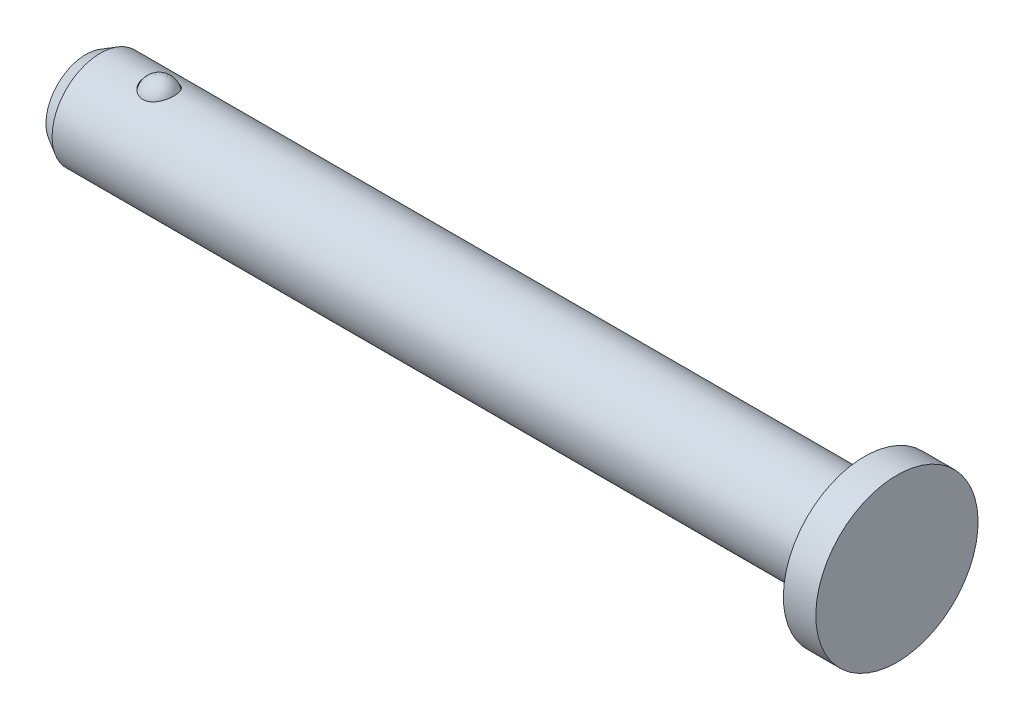
ISO-10303-21;
HEADER;
FILE_DESCRIPTION(('STEP AP214'),'2;1');
FILE_NAME('part.step','',(''),(''),'','','');
FILE_SCHEMA(('AUTOMOTIVE_DESIGN { 1 0 10303 214 1 1 1 1 }'));
ENDSEC;
DATA;
#1=APPLICATION_CONTEXT('core data for automotive mechanical design processes');
#2=APPLICATION_PROTOCOL_DEFINITION('international standard','automotive_design',2000,#1);
#3=PRODUCT_CONTEXT('',#1,'mechanical');
#4=PRODUCT('Part','Part','',(#3));
#5=PRODUCT_RELATED_PRODUCT_CATEGORY('part','',(#4));
#6=PRODUCT_DEFINITION_FORMATION('','',#4);
#7=PRODUCT_DEFINITION_CONTEXT('part definition',#1,'design');
#8=PRODUCT_DEFINITION('design','',#6,#7);
#9=PRODUCT_DEFINITION_SHAPE('','',#8);
#10=(LENGTH_UNIT() NAMED_UNIT(*) SI_UNIT(.MILLI.,.METRE.));
#11=(NAMED_UNIT(*) PLANE_ANGLE_UNIT() SI_UNIT($,.RADIAN.));
#12=(NAMED_UNIT(*) SI_UNIT($,.STERADIAN.) SOLID_ANGLE_UNIT());
#13=UNCERTAINTY_MEASURE_WITH_UNIT(LENGTH_MEASURE(1.E-05),#10,'distance_accuracy_value','');
#14=(GEOMETRIC_REPRESENTATION_CONTEXT(3) GLOBAL_UNCERTAINTY_ASSIGNED_CONTEXT((#13)) GLOBAL_UNIT_ASSIGNED_CONTEXT((#10,
#11,#12)) REPRESENTATION_CONTEXT('',''));
#15=CARTESIAN_POINT('',(0.,0.,0.));
#16=DIRECTION('',(0.,0.,1.));
#17=DIRECTION('',(1.,0.,0.));
#18=AXIS2_PLACEMENT_3D('',#15,#16,#17);
#19=CARTESIAN_POINT('',(-19.84375,0.,0.));
#20=DIRECTION('',(-1.,0.,0.));
#21=DIRECTION('',(0.,-1.,0.));
#22=AXIS2_PLACEMENT_3D('',#19,#20,#21);
#23=CYLINDRICAL_SURFACE('',#22,2.3622);
#24=CARTESIAN_POINT('',(-19.13509,0.,0.));
#25=DIRECTION('',(-1.,0.,0.));
#26=DIRECTION('',(0.,-1.,0.));
#27=AXIS2_PLACEMENT_3D('',#24,#25,#26);
#28=CIRCLE('',#27,2.3622);
#29=CARTESIAN_POINT('',(-19.13509,-2.3622,0.));
#30=VERTEX_POINT('',#29);
#31=EDGE_CURVE('P0_E27',#30,#30,#28,.T.);
#32=ORIENTED_EDGE('',*,*,#31,.F.);
#33=EDGE_LOOP('',(#32));
#34=FACE_BOUND('',#33,.T.);
#35=CARTESIAN_POINT('',(18.25625,0.,0.));
#36=DIRECTION('',(-1.,0.,0.));
#37=DIRECTION('',(0.,-1.,0.));
#38=AXIS2_PLACEMENT_3D('',#35,#36,#37);
#39=CIRCLE('',#38,2.3622);
#40=CARTESIAN_POINT('',(18.25625,-2.3622,0.));
#41=VERTEX_POINT('',#40);
#42=EDGE_CURVE('P0_E10',#41,#41,#39,.T.);
#43=ORIENTED_EDGE('',*,*,#42,.T.);
#44=EDGE_LOOP('',(#43));
#45=FACE_BOUND('',#44,.T.);
#46=CARTESIAN_POINT('',(-16.26235,2.22581604673215,-0.791032089178223));
#47=CARTESIAN_POINT('',(-16.3018338222643,2.22581576398312,-0.791032519638611));
#48=CARTESIAN_POINT('',(-16.3413151384197,2.22697971671572,-0.787780239460785));
#49=CARTESIAN_POINT('',(-16.4190911852111,2.23149491079169,-0.774896744356573));
#50=CARTESIAN_POINT('',(-16.4573858392532,2.2348462930174,-0.765265118565094));
#51=CARTESIAN_POINT('',(-16.531633713184,2.24333848583653,-0.739997800068515));
#52=CARTESIAN_POINT('',(-16.5675913296129,2.24847581373636,-0.724373786774381));
#53=CARTESIAN_POINT('',(-16.6363604141592,2.25998083212616,-0.687636848342259));
#54=CARTESIAN_POINT('',(-16.6691713829048,2.26634871742327,-0.666523053944658));
#55=CARTESIAN_POINT('',(-16.7319315200548,2.27988127975236,-0.618680689218365));
#56=CARTESIAN_POINT('',(-16.7617565640189,2.28706485050395,-0.59179497242801));
#57=CARTESIAN_POINT('',(-16.8167458077474,2.30133787147742,-0.533600878356375));
#58=CARTESIAN_POINT('',(-16.8419088865026,2.30842729868224,-0.502291440535603));
#59=CARTESIAN_POINT('',(-16.88866080437,2.32229610981989,-0.433849997368854));
#60=CARTESIAN_POINT('',(-16.9099016466427,2.32902369976236,-0.396469482014577));
#61=CARTESIAN_POINT('',(-16.9462545129409,2.34094584755715,-0.318610784362629));
#62=CARTESIAN_POINT('',(-16.9613651181152,2.34614005042941,-0.278131887514649));
#63=CARTESIAN_POINT('',(-16.9857004779035,2.3546627054261,-0.193473280151713));
#64=CARTESIAN_POINT('',(-16.9946653937695,2.35790814356074,-0.149210288520307));
#65=CARTESIAN_POINT('',(-17.005565894284,2.36186996349137,-0.0597154884593806));
#66=CARTESIAN_POINT('',(-17.0075008699652,2.36258612618922,-0.0144835964404188));
#67=CARTESIAN_POINT('',(-17.0042909971991,2.36141021290238,0.0762430533264944));
#68=CARTESIAN_POINT('',(-16.9990605263757,2.35948659277288,0.12173440739389));
#69=CARTESIAN_POINT('',(-16.9814508372294,2.35317206611294,0.211137527329617));
#70=CARTESIAN_POINT('',(-16.9690713024393,2.34878105035866,0.255049223179884));
#71=CARTESIAN_POINT('',(-16.9373785333382,2.33799474034002,0.340003755419017));
#72=CARTESIAN_POINT('',(-16.9180697195015,2.33160072420234,0.381048400920872));
#73=CARTESIAN_POINT('',(-16.8728542738949,2.31749884585933,0.459087628468663));
#74=CARTESIAN_POINT('',(-16.8469476298871,2.30979098121703,0.49608220300213));
#75=CARTESIAN_POINT('',(-16.7895191404422,2.2940716483114,0.564297213422603));
#76=CARTESIAN_POINT('',(-16.7580957761656,2.28606718272386,0.59560198834643));
#77=CARTESIAN_POINT('',(-16.6900563583582,2.27059247122217,0.65211919780701));
#78=CARTESIAN_POINT('',(-16.6534418764304,2.26312206464838,0.677333470010341));
#79=CARTESIAN_POINT('',(-16.5779492741709,2.25001785060625,0.719636287127462));
#80=CARTESIAN_POINT('',(-16.5392775456061,2.24431058256401,0.73706966099699));
#81=CARTESIAN_POINT('',(-16.4592512672779,2.23497292980211,0.764920542936363));
#82=CARTESIAN_POINT('',(-16.4178981594483,2.23134143896186,0.775341788088755));
#83=CARTESIAN_POINT('',(-16.336791790642,2.22680429519513,0.788273335332938));
#84=CARTESIAN_POINT('',(-16.2971273529941,2.2257265947787,0.791283526133024));
#85=CARTESIAN_POINT('',(-16.2178529464748,2.2259171339851,0.790747912230159));
#86=CARTESIAN_POINT('',(-16.1782429675224,2.227184856437,0.787203552820129));
#87=CARTESIAN_POINT('',(-16.101593807461,2.23183155461559,0.77392686631853));
#88=CARTESIAN_POINT('',(-16.0645129744794,2.23513795566731,0.764407057193666));
#89=CARTESIAN_POINT('',(-15.9924941222932,2.24343404277332,0.739703383423265));
#90=CARTESIAN_POINT('',(-15.9575563106065,2.24842389153994,0.724518971254892));
#91=CARTESIAN_POINT('',(-15.8896511257475,2.25973866548061,0.688430400089749));
#92=CARTESIAN_POINT('',(-15.8567728995766,2.26609879126542,0.667369988967333));
#93=CARTESIAN_POINT('',(-15.7948539005421,2.27941389290418,0.620368260180015));
#94=CARTESIAN_POINT('',(-15.7658141812176,2.28636903120949,0.594425607222328));
#95=CARTESIAN_POINT('',(-15.7103363875522,2.30067315029258,0.53650441012868));
#96=CARTESIAN_POINT('',(-15.6841940827522,2.30801802589022,0.504241497413384));
#97=CARTESIAN_POINT('',(-15.6373294223548,2.3219066096982,0.435840003810775));
#98=CARTESIAN_POINT('',(-15.6166085654881,2.32845009610334,0.399700355105054));
#99=CARTESIAN_POINT('',(-15.5799154074514,2.34044485511104,0.322365815909071));
#100=CARTESIAN_POINT('',(-15.5642733166028,2.34581462134006,0.281001264451536));
#101=CARTESIAN_POINT('',(-15.5396525932013,2.35443088539652,0.196122971548608));
#102=CARTESIAN_POINT('',(-15.5306749478103,2.35767706866266,0.152608912728051));
#103=CARTESIAN_POINT('',(-15.5193857562819,2.36177692867522,0.0635170638966761));
#104=CARTESIAN_POINT('',(-15.5172440137684,2.36256964717617,0.0179148433694454));
#105=CARTESIAN_POINT('',(-15.520139881845,2.3615088375365,-0.0730313594257117));
#106=CARTESIAN_POINT('',(-15.5251778997728,2.35965515925471,-0.118375326895323));
#107=CARTESIAN_POINT('',(-15.5423917858139,2.35347668943244,-0.207728305434119));
#108=CARTESIAN_POINT('',(-15.5545996260354,2.34914083140647,-0.251730402335729));
#109=CARTESIAN_POINT('',(-15.5859777734291,2.33844323829137,-0.33692140450069));
#110=CARTESIAN_POINT('',(-15.6051483348,2.33208142923882,-0.378110206989596));
#111=CARTESIAN_POINT('',(-15.6499743354645,2.31806542607961,-0.456209651369723));
#112=CARTESIAN_POINT('',(-15.6755888264204,2.31041949036449,-0.493145237461023));
#113=CARTESIAN_POINT('',(-15.7328670809521,2.29467177360045,-0.561885478042451));
#114=CARTESIAN_POINT('',(-15.7645302727704,2.28657003568757,-0.593690616967873));
#115=CARTESIAN_POINT('',(-15.8321103675284,2.27114006586694,-0.65018826947417));
#116=CARTESIAN_POINT('',(-15.8678630627565,2.26379555842983,-0.675072287191636));
#117=CARTESIAN_POINT('',(-15.9434509291089,2.25051576769323,-0.718107031490448));
#118=CARTESIAN_POINT('',(-15.9832838483709,2.24457971300892,-0.736261446834664));
#119=CARTESIAN_POINT('',(-16.0625351985796,2.23529527948482,-0.763964093369265));
#120=CARTESIAN_POINT('',(-16.1017351816544,2.23177879622831,-0.77408143316942));
#121=CARTESIAN_POINT('',(-16.1814079558051,2.22703972798425,-0.787614032349747));
#122=CARTESIAN_POINT('',(-16.221880294314,2.22581633654123,-0.79103164796954));
#123=CARTESIAN_POINT('',(-16.26235,2.22581604673215,-0.791032089178223));
#124=B_SPLINE_CURVE_WITH_KNOTS('',3,(#46,#47,#48,#49,#50,#51,#52,#53,#54,#55,#56,#57,#58,#59,
#60,#61,#62,#63,#64,#65,#66,#67,#68,#69,#70,#71,#72,#73,#74,#75,#76,#77,#78,#79,#80,#81,#82,#83,
#84,#85,#86,#87,#88,#89,#90,#91,#92,#93,#94,#95,#96,#97,#98,#99,#100,#101,#102,#103,#104,#105,
#106,#107,#108,#109,#110,#111,#112,#113,#114,#115,#116,#117,#118,#119,#120,#121,#122,#123),
.UNSPECIFIED.,.T.,.F.,(4,2,2,2,2,2,2,2,2,2,2,2,2,2,2,2,2,2,2,2,2,2,2,2,2,2,2,2,2,2,2,2,2,2,2,2,
2,2,4),(0.,0.118299361509028,0.236606342891336,0.354683901324815,0.472780167721913,
0.594630449676335,0.716509993647939,0.846477480289179,0.976475030932797,1.11167665655919,
1.24688999372124,1.38373321192027,1.52058248821507,1.65734461742627,1.79410700031295,
1.92863866932185,2.06312969570307,2.19085824756083,2.31851867302866,2.43729849240827,
2.55605212369601,2.6708045306772,2.78556803214262,2.90373452362426,3.02193338072498,
3.14788853933123,3.27387848087818,3.40691156896659,3.53996435847092,3.67629744685247,
3.81263827028837,3.94959173936421,4.08655020891101,4.22265943045034,4.35875579253439,
4.49059132495186,4.62235448583304,4.74365036609798,4.86490357990958),.UNSPECIFIED.);
#125=CARTESIAN_POINT('',(-16.26235,2.22581604673215,-0.791032089178223));
#126=VERTEX_POINT('',#125);
#127=EDGE_CURVE('P0_E19',#126,#126,#124,.T.);
#128=ORIENTED_EDGE('',*,*,#127,.F.);
#129=EDGE_LOOP('',(#128));
#130=FACE_BOUND('',#129,.T.);
#131=ADVANCED_FACE('P0_F15',(#34,#45,#130),#23,.T.);
#132=CARTESIAN_POINT('',(18.25625,2.3622,0.));
#133=DIRECTION('',(1.,0.,0.));
#134=DIRECTION('',(0.,1.,0.));
#135=AXIS2_PLACEMENT_3D('',#132,#133,#134);
#136=PLANE('',#135);
#137=ORIENTED_EDGE('',*,*,#42,.F.);
#138=EDGE_LOOP('',(#137));
#139=FACE_BOUND('',#138,.T.);
#140=CARTESIAN_POINT('',(18.25625,0.,0.));
#141=DIRECTION('',(-1.,0.,0.));
#142=DIRECTION('',(0.,-1.,0.));
#143=AXIS2_PLACEMENT_3D('',#140,#141,#142);
#144=CIRCLE('',#143,3.96875);
#145=CARTESIAN_POINT('',(18.25625,-3.96875,0.));
#146=VERTEX_POINT('',#145);
#147=EDGE_CURVE('P0_E39',#146,#146,#144,.T.);
#148=ORIENTED_EDGE('',*,*,#147,.T.);
#149=EDGE_LOOP('',(#148));
#150=FACE_BOUND('',#149,.T.);
#151=ADVANCED_FACE('P0_F17',(#139,#150),#136,.F.);
#152=CARTESIAN_POINT('',(-19.13509,0.,0.));
#153=DIRECTION('',(1.,0.,0.));
#154=DIRECTION('',(0.,1.,0.));
#155=AXIS2_PLACEMENT_3D('',#152,#153,#154);
#156=CONICAL_SURFACE('',#155,2.3622,0.523598775598299);
#157=CARTESIAN_POINT('',(-19.84375,0.,0.));
#158=DIRECTION('',(-1.,0.,0.));
#159=DIRECTION('',(0.,-1.,0.));
#160=AXIS2_PLACEMENT_3D('',#157,#158,#159);
#161=CIRCLE('',#160,1.95305495823608);
#162=CARTESIAN_POINT('',(-19.84375,-1.95305495823608,0.));
#163=VERTEX_POINT('',#162);
#164=EDGE_CURVE('P0_E31',#163,#163,#161,.T.);
#165=ORIENTED_EDGE('',*,*,#164,.F.);
#166=EDGE_LOOP('',(#165));
#167=FACE_BOUND('',#166,.T.);
#168=ORIENTED_EDGE('',*,*,#31,.T.);
#169=EDGE_LOOP('',(#168));
#170=FACE_BOUND('',#169,.T.);
#171=ADVANCED_FACE('P0_F55',(#167,#170),#156,.T.);
#172=CARTESIAN_POINT('',(-19.84375,1.95305495823608,0.));
#173=DIRECTION('',(1.,0.,0.));
#174=DIRECTION('',(0.,1.,0.));
#175=AXIS2_PLACEMENT_3D('',#172,#173,#174);
#176=PLANE('',#175);
#177=ORIENTED_EDGE('',*,*,#164,.T.);
#178=EDGE_LOOP('',(#177));
#179=FACE_BOUND('',#178,.T.);
#180=ADVANCED_FACE('P0_F62',(#179),#176,.F.);
#181=CARTESIAN_POINT('',(19.84375,3.96875,0.));
#182=DIRECTION('',(-1.,0.,0.));
#183=DIRECTION('',(0.,-1.,0.));
#184=AXIS2_PLACEMENT_3D('',#181,#182,#183);
#185=PLANE('',#184);
#186=CARTESIAN_POINT('',(19.84375,0.,0.));
#187=DIRECTION('',(-1.,0.,0.));
#188=DIRECTION('',(0.,-1.,0.));
#189=AXIS2_PLACEMENT_3D('',#186,#187,#188);
#190=CIRCLE('',#189,3.96875);
#191=CARTESIAN_POINT('',(19.84375,-3.96875,0.));
#192=VERTEX_POINT('',#191);
#193=EDGE_CURVE('P0_E36',#192,#192,#190,.T.);
#194=ORIENTED_EDGE('',*,*,#193,.F.);
#195=EDGE_LOOP('',(#194));
#196=FACE_BOUND('',#195,.T.);
#197=ADVANCED_FACE('P0_F66',(#196),#185,.F.);
#198=CARTESIAN_POINT('',(-19.84375,0.,0.));
#199=DIRECTION('',(-1.,0.,0.));
#200=DIRECTION('',(0.,-1.,0.));
#201=AXIS2_PLACEMENT_3D('',#198,#199,#200);
#202=CYLINDRICAL_SURFACE('',#201,3.96875);
#203=ORIENTED_EDGE('',*,*,#147,.F.);
#204=EDGE_LOOP('',(#203));
#205=FACE_BOUND('',#204,.T.);
#206=ORIENTED_EDGE('',*,*,#193,.T.);
#207=EDGE_LOOP('',(#206));
#208=FACE_BOUND('',#207,.T.);
#209=ADVANCED_FACE('P0_F70',(#205,#208),#202,.T.);
#210=CARTESIAN_POINT('',(-16.26235,2.02985730626251,0.));
#211=DIRECTION('',(-1.,0.,0.));
#212=DIRECTION('',(0.,1.,0.));
#213=AXIS2_PLACEMENT_3D('',#210,#211,#212);
#214=SPHERICAL_SURFACE('',#213,0.814942693737488);
#215=ORIENTED_EDGE('',*,*,#127,.T.);
#216=EDGE_LOOP('',(#215));
#217=FACE_BOUND('',#216,.T.);
#218=ADVANCED_FACE('P0_F46',(#217),#214,.F.);
#219=CLOSED_SHELL('',(#131,#151,#171,#180,#197,#209,#218));
#220=MANIFOLD_SOLID_BREP('P0_B1',#219);
#221=CARTESIAN_POINT('',(-16.26235,2.02985730626251,0.));
#222=DIRECTION('',(-1.,0.,0.));
#223=DIRECTION('',(0.,1.,0.));
#224=AXIS2_PLACEMENT_3D('',#221,#222,#223);
#225=SPHERICAL_SURFACE('',#224,0.789542693737488);
#226=CARTESIAN_POINT('',(-17.0518926937375,2.02985730626251,0.));
#227=VERTEX_POINT('',#226);
#228=VERTEX_LOOP('',#227);
#229=FACE_BOUND('',#228,.T.);
#230=ADVANCED_FACE('P1_F13',(#229),#225,.T.);
#231=CLOSED_SHELL('',(#230));
#232=MANIFOLD_SOLID_BREP('P1_B1',#231);
#233=ADVANCED_BREP_SHAPE_REPRESENTATION('',(#18,#220,#232),#14);
#234=SHAPE_DEFINITION_REPRESENTATION(#9,#233);
ENDSEC;
END-ISO-10303-21;
